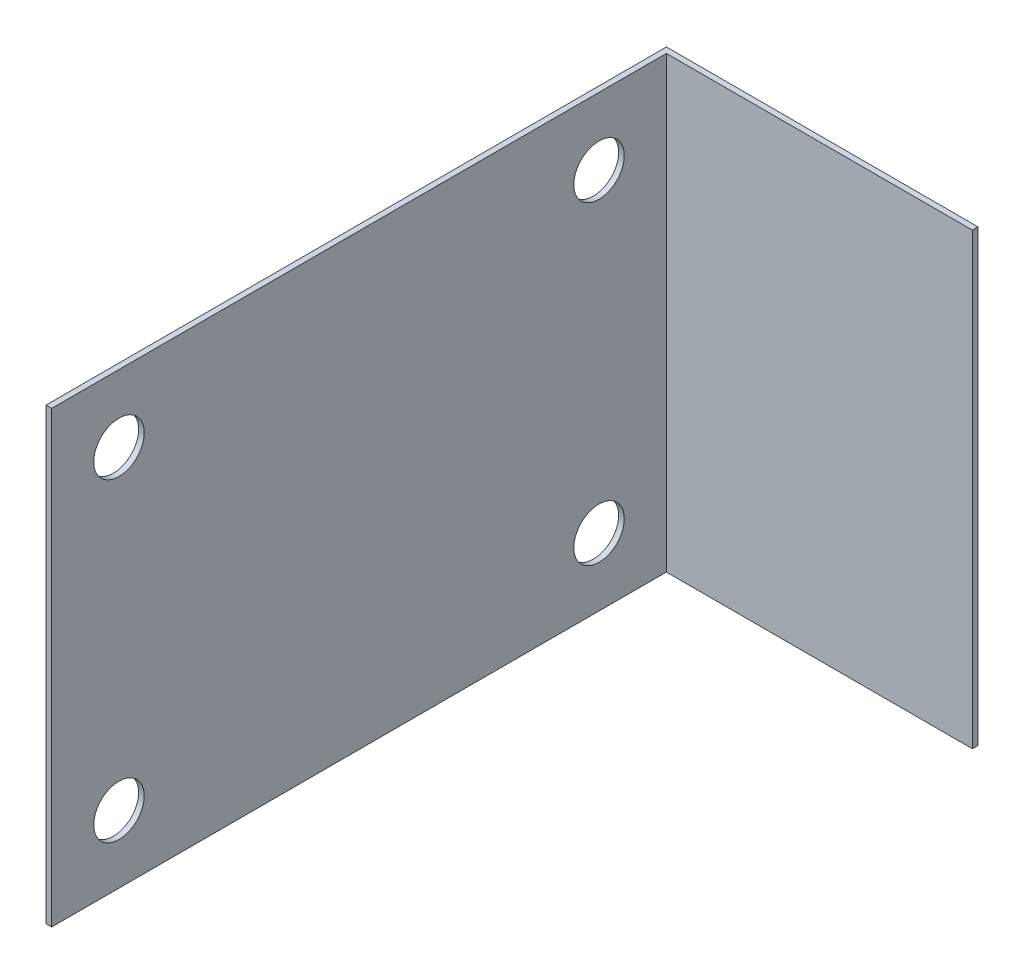
ISO-10303-21;
HEADER;
FILE_DESCRIPTION(('STEP AP214'),'2;1');
FILE_NAME('part.step','',(''),(''),'','','');
FILE_SCHEMA(('AUTOMOTIVE_DESIGN { 1 0 10303 214 1 1 1 1 }'));
ENDSEC;
DATA;
#1=APPLICATION_CONTEXT('core data for automotive mechanical design processes');
#2=APPLICATION_PROTOCOL_DEFINITION('international standard','automotive_design',2000,#1);
#3=PRODUCT_CONTEXT('',#1,'mechanical');
#4=PRODUCT('Part','Part','',(#3));
#5=PRODUCT_RELATED_PRODUCT_CATEGORY('part','',(#4));
#6=PRODUCT_DEFINITION_FORMATION('','',#4);
#7=PRODUCT_DEFINITION_CONTEXT('part definition',#1,'design');
#8=PRODUCT_DEFINITION('design','',#6,#7);
#9=PRODUCT_DEFINITION_SHAPE('','',#8);
#10=(LENGTH_UNIT() NAMED_UNIT(*) SI_UNIT(.MILLI.,.METRE.));
#11=(NAMED_UNIT(*) PLANE_ANGLE_UNIT() SI_UNIT($,.RADIAN.));
#12=(NAMED_UNIT(*) SI_UNIT($,.STERADIAN.) SOLID_ANGLE_UNIT());
#13=UNCERTAINTY_MEASURE_WITH_UNIT(LENGTH_MEASURE(1.E-05),#10,'distance_accuracy_value','');
#14=(GEOMETRIC_REPRESENTATION_CONTEXT(3) GLOBAL_UNCERTAINTY_ASSIGNED_CONTEXT((#13)) GLOBAL_UNIT_ASSIGNED_CONTEXT((#10,
#11,#12)) REPRESENTATION_CONTEXT('',''));
#15=CARTESIAN_POINT('',(0.,0.,0.));
#16=DIRECTION('',(0.,0.,1.));
#17=DIRECTION('',(1.,0.,0.));
#18=AXIS2_PLACEMENT_3D('',#15,#16,#17);
#19=CARTESIAN_POINT('',(0.,127.,-350.8375));
#20=DIRECTION('',(1.,0.,0.));
#21=DIRECTION('',(0.,0.,-1.));
#22=AXIS2_PLACEMENT_3D('',#19,#20,#21);
#23=PLANE('',#22);
#24=CARTESIAN_POINT('',(0.,88.9,-309.5625));
#25=DIRECTION('',(1.,0.,0.));
#26=DIRECTION('',(0.,0.,1.));
#27=AXIS2_PLACEMENT_3D('',#24,#25,#26);
#28=CIRCLE('',#27,14.2748);
#29=CARTESIAN_POINT('',(0.,88.9,-295.2877));
#30=VERTEX_POINT('',#29);
#31=EDGE_CURVE('E160',#30,#30,#28,.T.);
#32=ORIENTED_EDGE('',*,*,#31,.T.);
#33=EDGE_LOOP('',(#32));
#34=FACE_BOUND('',#33,.T.);
#35=CARTESIAN_POINT('',(0.,-88.9,-38.1));
#36=DIRECTION('',(1.,0.,0.));
#37=DIRECTION('',(0.,0.,1.));
#38=AXIS2_PLACEMENT_3D('',#35,#36,#37);
#39=CIRCLE('',#38,14.2748);
#40=CARTESIAN_POINT('',(0.,-88.9,-23.8252));
#41=VERTEX_POINT('',#40);
#42=EDGE_CURVE('E164',#41,#41,#39,.T.);
#43=ORIENTED_EDGE('',*,*,#42,.T.);
#44=EDGE_LOOP('',(#43));
#45=FACE_BOUND('',#44,.T.);
#46=CARTESIAN_POINT('',(0.,88.9,-38.1));
#47=DIRECTION('',(1.,0.,0.));
#48=DIRECTION('',(0.,0.,-1.));
#49=AXIS2_PLACEMENT_3D('',#46,#47,#48);
#50=CIRCLE('',#49,14.2748);
#51=CARTESIAN_POINT('',(0.,88.9,-52.3748));
#52=VERTEX_POINT('',#51);
#53=EDGE_CURVE('E168',#52,#52,#50,.T.);
#54=ORIENTED_EDGE('',*,*,#53,.T.);
#55=EDGE_LOOP('',(#54));
#56=FACE_BOUND('',#55,.T.);
#57=CARTESIAN_POINT('',(0.,-88.9,-309.5625));
#58=DIRECTION('',(1.,0.,0.));
#59=DIRECTION('',(0.,0.,-1.));
#60=AXIS2_PLACEMENT_3D('',#57,#58,#59);
#61=CIRCLE('',#60,14.2748);
#62=CARTESIAN_POINT('',(0.,-88.9,-323.8373));
#63=VERTEX_POINT('',#62);
#64=EDGE_CURVE('E121',#63,#63,#61,.T.);
#65=ORIENTED_EDGE('',*,*,#64,.T.);
#66=EDGE_LOOP('',(#65));
#67=FACE_BOUND('',#66,.T.);
#68=DIRECTION('',(0.,0.,1.));
#69=VECTOR('',#68,1.);
#70=CARTESIAN_POINT('',(0.,-127.,-350.8375));
#71=LINE('',#70,#69);
#72=CARTESIAN_POINT('',(0.,-127.,-350.8375));
#73=VERTEX_POINT('',#72);
#74=CARTESIAN_POINT('',(0.,-127.,0.));
#75=VERTEX_POINT('',#74);
#76=EDGE_CURVE('E117',#73,#75,#71,.T.);
#77=ORIENTED_EDGE('',*,*,#76,.T.);
#78=DIRECTION('',(0.,-1.,0.));
#79=VECTOR('',#78,1.);
#80=CARTESIAN_POINT('',(0.,127.,0.));
#81=LINE('',#80,#79);
#82=CARTESIAN_POINT('',(0.,127.,0.));
#83=VERTEX_POINT('',#82);
#84=EDGE_CURVE('E11',#83,#75,#81,.T.);
#85=ORIENTED_EDGE('',*,*,#84,.F.);
#86=DIRECTION('',(0.,0.,1.));
#87=VECTOR('',#86,1.);
#88=CARTESIAN_POINT('',(0.,127.,-350.8375));
#89=LINE('',#88,#87);
#90=CARTESIAN_POINT('',(0.,127.,-350.8375));
#91=VERTEX_POINT('',#90);
#92=EDGE_CURVE('E128',#91,#83,#89,.T.);
#93=ORIENTED_EDGE('',*,*,#92,.F.);
#94=DIRECTION('',(0.,-1.,0.));
#95=VECTOR('',#94,1.);
#96=CARTESIAN_POINT('',(0.,127.,-350.8375));
#97=LINE('',#96,#95);
#98=EDGE_CURVE('E113',#91,#73,#97,.T.);
#99=ORIENTED_EDGE('',*,*,#98,.T.);
#100=EDGE_LOOP('',(#77,#85,#93,#99));
#101=FACE_BOUND('',#100,.T.);
#102=ADVANCED_FACE('F33',(#34,#45,#56,#67,#101),#23,.F.);
#103=CARTESIAN_POINT('',(0.,127.,0.));
#104=DIRECTION('',(0.,0.,-1.));
#105=DIRECTION('',(-1.,0.,0.));
#106=AXIS2_PLACEMENT_3D('',#103,#104,#105);
#107=PLANE('',#106);
#108=DIRECTION('',(1.,0.,0.));
#109=VECTOR('',#108,1.);
#110=CARTESIAN_POINT('',(0.,-127.,0.));
#111=LINE('',#110,#109);
#112=CARTESIAN_POINT('',(3.175,-127.,0.));
#113=VERTEX_POINT('',#112);
#114=EDGE_CURVE('E120',#75,#113,#111,.T.);
#115=ORIENTED_EDGE('',*,*,#114,.T.);
#116=DIRECTION('',(0.,-1.,0.));
#117=VECTOR('',#116,1.);
#118=CARTESIAN_POINT('',(3.175,127.,0.));
#119=LINE('',#118,#117);
#120=CARTESIAN_POINT('',(3.175,127.,0.));
#121=VERTEX_POINT('',#120);
#122=EDGE_CURVE('E41',#121,#113,#119,.T.);
#123=ORIENTED_EDGE('',*,*,#122,.F.);
#124=DIRECTION('',(1.,0.,0.));
#125=VECTOR('',#124,1.);
#126=CARTESIAN_POINT('',(0.,127.,0.));
#127=LINE('',#126,#125);
#128=EDGE_CURVE('E86',#83,#121,#127,.T.);
#129=ORIENTED_EDGE('',*,*,#128,.F.);
#130=ORIENTED_EDGE('',*,*,#84,.T.);
#131=EDGE_LOOP('',(#115,#123,#129,#130));
#132=FACE_BOUND('',#131,.T.);
#133=ADVANCED_FACE('F152',(#132),#107,.F.);
#134=CARTESIAN_POINT('',(3.175,127.,0.));
#135=DIRECTION('',(-1.,0.,0.));
#136=DIRECTION('',(0.,0.,1.));
#137=AXIS2_PLACEMENT_3D('',#134,#135,#136);
#138=PLANE('',#137);
#139=CARTESIAN_POINT('',(3.175,88.9,-309.5625));
#140=DIRECTION('',(1.,0.,0.));
#141=DIRECTION('',(0.,0.,1.));
#142=AXIS2_PLACEMENT_3D('',#139,#140,#141);
#143=CIRCLE('',#142,14.2748);
#144=CARTESIAN_POINT('',(3.175,88.9,-295.2877));
#145=VERTEX_POINT('',#144);
#146=EDGE_CURVE('E183',#145,#145,#143,.T.);
#147=ORIENTED_EDGE('',*,*,#146,.F.);
#148=EDGE_LOOP('',(#147));
#149=FACE_BOUND('',#148,.T.);
#150=CARTESIAN_POINT('',(3.175,-88.9,-38.1));
#151=DIRECTION('',(1.,0.,0.));
#152=DIRECTION('',(0.,0.,1.));
#153=AXIS2_PLACEMENT_3D('',#150,#151,#152);
#154=CIRCLE('',#153,14.2748);
#155=CARTESIAN_POINT('',(3.175,-88.9,-23.8252));
#156=VERTEX_POINT('',#155);
#157=EDGE_CURVE('E177',#156,#156,#154,.T.);
#158=ORIENTED_EDGE('',*,*,#157,.F.);
#159=EDGE_LOOP('',(#158));
#160=FACE_BOUND('',#159,.T.);
#161=CARTESIAN_POINT('',(3.175,88.9,-38.1));
#162=DIRECTION('',(1.,0.,0.));
#163=DIRECTION('',(0.,0.,-1.));
#164=AXIS2_PLACEMENT_3D('',#161,#162,#163);
#165=CIRCLE('',#164,14.2748);
#166=CARTESIAN_POINT('',(3.175,88.9,-52.3748));
#167=VERTEX_POINT('',#166);
#168=EDGE_CURVE('E187',#167,#167,#165,.T.);
#169=ORIENTED_EDGE('',*,*,#168,.F.);
#170=EDGE_LOOP('',(#169));
#171=FACE_BOUND('',#170,.T.);
#172=CARTESIAN_POINT('',(3.175,-88.9,-309.5625));
#173=DIRECTION('',(1.,0.,0.));
#174=DIRECTION('',(0.,0.,-1.));
#175=AXIS2_PLACEMENT_3D('',#172,#173,#174);
#176=CIRCLE('',#175,14.2748);
#177=CARTESIAN_POINT('',(3.175,-88.9,-323.8373));
#178=VERTEX_POINT('',#177);
#179=EDGE_CURVE('E172',#178,#178,#176,.T.);
#180=ORIENTED_EDGE('',*,*,#179,.F.);
#181=EDGE_LOOP('',(#180));
#182=FACE_BOUND('',#181,.T.);
#183=DIRECTION('',(0.,0.,-1.));
#184=VECTOR('',#183,1.);
#185=CARTESIAN_POINT('',(3.175,-127.,0.));
#186=LINE('',#185,#184);
#187=CARTESIAN_POINT('',(3.175,-127.,-347.6625));
#188=VERTEX_POINT('',#187);
#189=EDGE_CURVE('E123',#113,#188,#186,.T.);
#190=ORIENTED_EDGE('',*,*,#189,.T.);
#191=DIRECTION('',(0.,-1.,0.));
#192=VECTOR('',#191,1.);
#193=CARTESIAN_POINT('',(3.175,127.,-347.6625));
#194=LINE('',#193,#192);
#195=CARTESIAN_POINT('',(3.175,127.,-347.6625));
#196=VERTEX_POINT('',#195);
#197=EDGE_CURVE('E108',#196,#188,#194,.T.);
#198=ORIENTED_EDGE('',*,*,#197,.F.);
#199=DIRECTION('',(0.,0.,-1.));
#200=VECTOR('',#199,1.);
#201=CARTESIAN_POINT('',(3.175,127.,0.));
#202=LINE('',#201,#200);
#203=EDGE_CURVE('E99',#121,#196,#202,.T.);
#204=ORIENTED_EDGE('',*,*,#203,.F.);
#205=ORIENTED_EDGE('',*,*,#122,.T.);
#206=EDGE_LOOP('',(#190,#198,#204,#205));
#207=FACE_BOUND('',#206,.T.);
#208=ADVANCED_FACE('F134',(#149,#160,#171,#182,#207),#138,.F.);
#209=CARTESIAN_POINT('',(3.175,127.,-347.6625));
#210=DIRECTION('',(0.,0.,-1.));
#211=DIRECTION('',(-1.,0.,0.));
#212=AXIS2_PLACEMENT_3D('',#209,#210,#211);
#213=PLANE('',#212);
#214=DIRECTION('',(1.,0.,0.));
#215=VECTOR('',#214,1.);
#216=CARTESIAN_POINT('',(3.175,-127.,-347.6625));
#217=LINE('',#216,#215);
#218=CARTESIAN_POINT('',(176.2125,-127.,-347.6625));
#219=VERTEX_POINT('',#218);
#220=EDGE_CURVE('E107',#188,#219,#217,.T.);
#221=ORIENTED_EDGE('',*,*,#220,.T.);
#222=DIRECTION('',(0.,-1.,0.));
#223=VECTOR('',#222,1.);
#224=CARTESIAN_POINT('',(176.2125,127.,-347.6625));
#225=LINE('',#224,#223);
#226=CARTESIAN_POINT('',(176.2125,127.,-347.6625));
#227=VERTEX_POINT('',#226);
#228=EDGE_CURVE('E104',#227,#219,#225,.T.);
#229=ORIENTED_EDGE('',*,*,#228,.F.);
#230=DIRECTION('',(1.,0.,0.));
#231=VECTOR('',#230,1.);
#232=CARTESIAN_POINT('',(3.175,127.,-347.6625));
#233=LINE('',#232,#231);
#234=EDGE_CURVE('E93',#196,#227,#233,.T.);
#235=ORIENTED_EDGE('',*,*,#234,.F.);
#236=ORIENTED_EDGE('',*,*,#197,.T.);
#237=EDGE_LOOP('',(#221,#229,#235,#236));
#238=FACE_BOUND('',#237,.T.);
#239=ADVANCED_FACE('F105',(#238),#213,.F.);
#240=CARTESIAN_POINT('',(176.2125,127.,-347.6625));
#241=DIRECTION('',(-1.,0.,0.));
#242=DIRECTION('',(0.,0.,1.));
#243=AXIS2_PLACEMENT_3D('',#240,#241,#242);
#244=PLANE('',#243);
#245=DIRECTION('',(0.,0.,-1.));
#246=VECTOR('',#245,1.);
#247=CARTESIAN_POINT('',(176.2125,-127.,-347.6625));
#248=LINE('',#247,#246);
#249=CARTESIAN_POINT('',(176.2125,-127.,-350.8375));
#250=VERTEX_POINT('',#249);
#251=EDGE_CURVE('E72',#219,#250,#248,.T.);
#252=ORIENTED_EDGE('',*,*,#251,.T.);
#253=DIRECTION('',(0.,-1.,0.));
#254=VECTOR('',#253,1.);
#255=CARTESIAN_POINT('',(176.2125,127.,-350.8375));
#256=LINE('',#255,#254);
#257=CARTESIAN_POINT('',(176.2125,127.,-350.8375));
#258=VERTEX_POINT('',#257);
#259=EDGE_CURVE('E109',#258,#250,#256,.T.);
#260=ORIENTED_EDGE('',*,*,#259,.F.);
#261=DIRECTION('',(0.,0.,-1.));
#262=VECTOR('',#261,1.);
#263=CARTESIAN_POINT('',(176.2125,127.,-347.6625));
#264=LINE('',#263,#262);
#265=EDGE_CURVE('E97',#227,#258,#264,.T.);
#266=ORIENTED_EDGE('',*,*,#265,.F.);
#267=ORIENTED_EDGE('',*,*,#228,.T.);
#268=EDGE_LOOP('',(#252,#260,#266,#267));
#269=FACE_BOUND('',#268,.T.);
#270=ADVANCED_FACE('F111',(#269),#244,.F.);
#271=CARTESIAN_POINT('',(176.2125,127.,-350.8375));
#272=DIRECTION('',(0.,0.,1.));
#273=DIRECTION('',(1.,0.,0.));
#274=AXIS2_PLACEMENT_3D('',#271,#272,#273);
#275=PLANE('',#274);
#276=DIRECTION('',(-1.,0.,0.));
#277=VECTOR('',#276,1.);
#278=CARTESIAN_POINT('',(176.2125,-127.,-350.8375));
#279=LINE('',#278,#277);
#280=EDGE_CURVE('E78',#250,#73,#279,.T.);
#281=ORIENTED_EDGE('',*,*,#280,.T.);
#282=ORIENTED_EDGE('',*,*,#98,.F.);
#283=DIRECTION('',(-1.,0.,0.));
#284=VECTOR('',#283,1.);
#285=CARTESIAN_POINT('',(176.2125,127.,-350.8375));
#286=LINE('',#285,#284);
#287=EDGE_CURVE('E49',#258,#91,#286,.T.);
#288=ORIENTED_EDGE('',*,*,#287,.F.);
#289=ORIENTED_EDGE('',*,*,#259,.T.);
#290=EDGE_LOOP('',(#281,#282,#288,#289));
#291=FACE_BOUND('',#290,.T.);
#292=ADVANCED_FACE('F141',(#291),#275,.F.);
#293=CARTESIAN_POINT('',(0.,127.,0.));
#294=DIRECTION('',(0.,1.,0.));
#295=DIRECTION('',(0.,0.,1.));
#296=AXIS2_PLACEMENT_3D('',#293,#294,#295);
#297=PLANE('',#296);
#298=ORIENTED_EDGE('',*,*,#92,.T.);
#299=ORIENTED_EDGE('',*,*,#128,.T.);
#300=ORIENTED_EDGE('',*,*,#203,.T.);
#301=ORIENTED_EDGE('',*,*,#234,.T.);
#302=ORIENTED_EDGE('',*,*,#265,.T.);
#303=ORIENTED_EDGE('',*,*,#287,.T.);
#304=EDGE_LOOP('',(#298,#299,#300,#301,#302,#303));
#305=FACE_BOUND('',#304,.T.);
#306=ADVANCED_FACE('F95',(#305),#297,.T.);
#307=CARTESIAN_POINT('',(0.,-127.,0.));
#308=DIRECTION('',(0.,1.,0.));
#309=DIRECTION('',(0.,0.,1.));
#310=AXIS2_PLACEMENT_3D('',#307,#308,#309);
#311=PLANE('',#310);
#312=ORIENTED_EDGE('',*,*,#76,.F.);
#313=ORIENTED_EDGE('',*,*,#280,.F.);
#314=ORIENTED_EDGE('',*,*,#251,.F.);
#315=ORIENTED_EDGE('',*,*,#220,.F.);
#316=ORIENTED_EDGE('',*,*,#189,.F.);
#317=ORIENTED_EDGE('',*,*,#114,.F.);
#318=EDGE_LOOP('',(#312,#313,#314,#315,#316,#317));
#319=FACE_BOUND('',#318,.T.);
#320=ADVANCED_FACE('F137',(#319),#311,.F.);
#321=CARTESIAN_POINT('',(0.,-88.9,-309.5625));
#322=DIRECTION('',(1.,0.,0.));
#323=DIRECTION('',(0.,0.,-1.));
#324=AXIS2_PLACEMENT_3D('',#321,#322,#323);
#325=CYLINDRICAL_SURFACE('',#324,14.2748);
#326=ORIENTED_EDGE('',*,*,#64,.F.);
#327=EDGE_LOOP('',(#326));
#328=FACE_BOUND('',#327,.T.);
#329=ORIENTED_EDGE('',*,*,#179,.T.);
#330=EDGE_LOOP('',(#329));
#331=FACE_BOUND('',#330,.T.);
#332=ADVANCED_FACE('F200',(#328,#331),#325,.F.);
#333=CARTESIAN_POINT('',(0.,88.9,-38.1));
#334=DIRECTION('',(1.,0.,0.));
#335=DIRECTION('',(0.,0.,-1.));
#336=AXIS2_PLACEMENT_3D('',#333,#334,#335);
#337=CYLINDRICAL_SURFACE('',#336,14.2748);
#338=ORIENTED_EDGE('',*,*,#53,.F.);
#339=EDGE_LOOP('',(#338));
#340=FACE_BOUND('',#339,.T.);
#341=ORIENTED_EDGE('',*,*,#168,.T.);
#342=EDGE_LOOP('',(#341));
#343=FACE_BOUND('',#342,.T.);
#344=ADVANCED_FACE('F192',(#340,#343),#337,.F.);
#345=CARTESIAN_POINT('',(0.,-88.9,-38.1));
#346=DIRECTION('',(1.,0.,0.));
#347=DIRECTION('',(0.,0.,-1.));
#348=AXIS2_PLACEMENT_3D('',#345,#346,#347);
#349=CYLINDRICAL_SURFACE('',#348,14.2748);
#350=ORIENTED_EDGE('',*,*,#42,.F.);
#351=EDGE_LOOP('',(#350));
#352=FACE_BOUND('',#351,.T.);
#353=ORIENTED_EDGE('',*,*,#157,.T.);
#354=EDGE_LOOP('',(#353));
#355=FACE_BOUND('',#354,.T.);
#356=ADVANCED_FACE('F207',(#352,#355),#349,.F.);
#357=CARTESIAN_POINT('',(0.,88.9,-309.5625));
#358=DIRECTION('',(1.,0.,0.));
#359=DIRECTION('',(0.,0.,-1.));
#360=AXIS2_PLACEMENT_3D('',#357,#358,#359);
#361=CYLINDRICAL_SURFACE('',#360,14.2748);
#362=ORIENTED_EDGE('',*,*,#31,.F.);
#363=EDGE_LOOP('',(#362));
#364=FACE_BOUND('',#363,.T.);
#365=ORIENTED_EDGE('',*,*,#146,.T.);
#366=EDGE_LOOP('',(#365));
#367=FACE_BOUND('',#366,.T.);
#368=ADVANCED_FACE('F213',(#364,#367),#361,.F.);
#369=CLOSED_SHELL('',(#102,#133,#208,#239,#270,#292,#306,#320,#332,#344,#356,#368));
#370=MANIFOLD_SOLID_BREP('B2',#369);
#371=ADVANCED_BREP_SHAPE_REPRESENTATION('',(#18,#370),#14);
#372=SHAPE_DEFINITION_REPRESENTATION(#9,#371);
ENDSEC;
END-ISO-10303-21;
